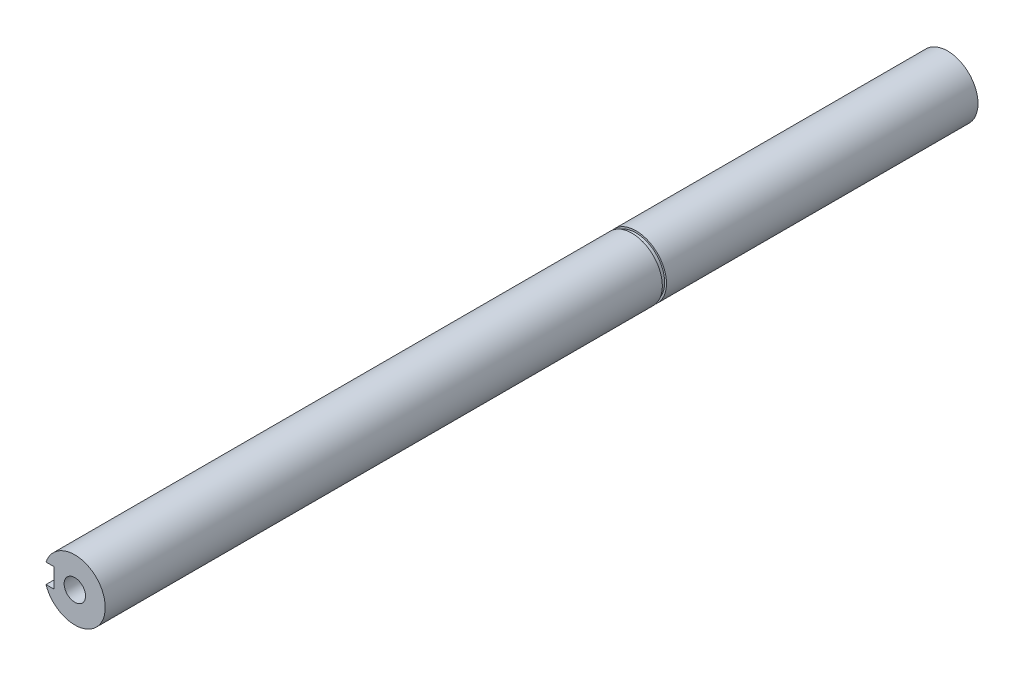
ISO-10303-21;
HEADER;
FILE_DESCRIPTION(('STEP AP214'),'2;1');
FILE_NAME('part.step','',(''),(''),'','','');
FILE_SCHEMA(('AUTOMOTIVE_DESIGN { 1 0 10303 214 1 1 1 1 }'));
ENDSEC;
DATA;
#1=APPLICATION_CONTEXT('core data for automotive mechanical design processes');
#2=APPLICATION_PROTOCOL_DEFINITION('international standard','automotive_design',2000,#1);
#3=PRODUCT_CONTEXT('',#1,'mechanical');
#4=PRODUCT('Part','Part','',(#3));
#5=PRODUCT_RELATED_PRODUCT_CATEGORY('part','',(#4));
#6=PRODUCT_DEFINITION_FORMATION('','',#4);
#7=PRODUCT_DEFINITION_CONTEXT('part definition',#1,'design');
#8=PRODUCT_DEFINITION('design','',#6,#7);
#9=PRODUCT_DEFINITION_SHAPE('','',#8);
#10=(LENGTH_UNIT() NAMED_UNIT(*) SI_UNIT(.MILLI.,.METRE.));
#11=(NAMED_UNIT(*) PLANE_ANGLE_UNIT() SI_UNIT($,.RADIAN.));
#12=(NAMED_UNIT(*) SI_UNIT($,.STERADIAN.) SOLID_ANGLE_UNIT());
#13=UNCERTAINTY_MEASURE_WITH_UNIT(LENGTH_MEASURE(1.E-05),#10,'distance_accuracy_value','');
#14=(GEOMETRIC_REPRESENTATION_CONTEXT(3) GLOBAL_UNCERTAINTY_ASSIGNED_CONTEXT((#13)) GLOBAL_UNIT_ASSIGNED_CONTEXT((#10,
#11,#12)) REPRESENTATION_CONTEXT('',''));
#15=CARTESIAN_POINT('',(0.,0.,0.));
#16=DIRECTION('',(0.,0.,1.));
#17=DIRECTION('',(1.,0.,0.));
#18=AXIS2_PLACEMENT_3D('',#15,#16,#17);
#19=CARTESIAN_POINT('',(1.72084568816899E-12,-291.807573628489,-395.955339059327));
#20=DIRECTION('',(0.,0.,1.));
#21=DIRECTION('',(1.,0.,0.));
#22=AXIS2_PLACEMENT_3D('',#19,#20,#21);
#23=CYLINDRICAL_SURFACE('',#22,12.5);
#24=DIRECTION('',(0.,0.,1.));
#25=VECTOR('',#24,1.);
#26=CARTESIAN_POINT('',(-11.8427192823253,-287.807573628489,-395.955339059327));
#27=LINE('',#26,#25);
#28=CARTESIAN_POINT('',(-11.8427192823253,-287.807573628489,0.));
#29=VERTEX_POINT('',#28);
#30=CARTESIAN_POINT('',(-11.8427192823253,-287.807573628489,-30.));
#31=VERTEX_POINT('',#30);
#32=EDGE_CURVE('E202',#29,#31,#27,.F.);
#33=ORIENTED_EDGE('',*,*,#32,.F.);
#34=CARTESIAN_POINT('',(1.72084568816899E-12,-291.807573628489,0.));
#35=DIRECTION('',(0.,0.,1.));
#36=DIRECTION('',(1.,0.,0.));
#37=AXIS2_PLACEMENT_3D('',#34,#35,#36);
#38=CIRCLE('',#37,12.5);
#39=CARTESIAN_POINT('',(-11.8427192823253,-295.807573628489,0.));
#40=VERTEX_POINT('',#39);
#41=EDGE_CURVE('E192',#40,#29,#38,.T.);
#42=ORIENTED_EDGE('',*,*,#41,.F.);
#43=DIRECTION('',(0.,0.,1.));
#44=VECTOR('',#43,1.);
#45=CARTESIAN_POINT('',(-11.8427192823253,-295.807573628489,-395.955339059327));
#46=LINE('',#45,#44);
#47=CARTESIAN_POINT('',(-11.8427192823253,-295.807573628489,-30.));
#48=VERTEX_POINT('',#47);
#49=EDGE_CURVE('E198',#48,#40,#46,.T.);
#50=ORIENTED_EDGE('',*,*,#49,.F.);
#51=CARTESIAN_POINT('',(1.72084568816899E-12,-291.807573628489,-30.));
#52=DIRECTION('',(0.,0.,-1.));
#53=DIRECTION('',(-1.,0.,0.));
#54=AXIS2_PLACEMENT_3D('',#51,#52,#53);
#55=CIRCLE('',#54,12.5);
#56=EDGE_CURVE('E200',#31,#48,#55,.F.);
#57=ORIENTED_EDGE('',*,*,#56,.F.);
#58=EDGE_LOOP('',(#33,#42,#50,#57));
#59=FACE_BOUND('',#58,.T.);
#60=CARTESIAN_POINT('',(1.72084568816899E-12,-291.807573628489,-228.9));
#61=DIRECTION('',(0.,0.,-1.));
#62=DIRECTION('',(0.,1.,0.));
#63=AXIS2_PLACEMENT_3D('',#60,#61,#62);
#64=CIRCLE('',#63,12.5);
#65=CARTESIAN_POINT('',(1.72084568816899E-12,-279.307573628489,-228.9));
#66=VERTEX_POINT('',#65);
#67=EDGE_CURVE('E180',#66,#66,#64,.F.);
#68=ORIENTED_EDGE('',*,*,#67,.T.);
#69=EDGE_LOOP('',(#68));
#70=FACE_BOUND('',#69,.T.);
#71=ADVANCED_FACE('F48',(#59,#70),#23,.T.);
#72=CARTESIAN_POINT('',(1.72084568816899E-12,-291.807573628489,0.));
#73=DIRECTION('',(0.,0.,1.));
#74=DIRECTION('',(1.,0.,0.));
#75=AXIS2_PLACEMENT_3D('',#72,#73,#74);
#76=PLANE('',#75);
#77=CARTESIAN_POINT('',(1.72084568816899E-12,-291.807573628489,0.));
#78=DIRECTION('',(0.,0.,1.));
#79=DIRECTION('',(1.,0.,0.));
#80=AXIS2_PLACEMENT_3D('',#77,#78,#79);
#81=CIRCLE('',#80,4.4);
#82=CARTESIAN_POINT('',(4.40000000000172,-291.807573628489,0.));
#83=VERTEX_POINT('',#82);
#84=EDGE_CURVE('E133',#83,#83,#81,.T.);
#85=ORIENTED_EDGE('',*,*,#84,.F.);
#86=EDGE_LOOP('',(#85));
#87=FACE_BOUND('',#86,.T.);
#88=DIRECTION('',(-1.,0.,0.));
#89=VECTOR('',#88,1.);
#90=CARTESIAN_POINT('',(-16.4999999999983,-287.807573628489,0.));
#91=LINE('',#90,#89);
#92=CARTESIAN_POINT('',(-8.49999999999829,-287.807573628489,0.));
#93=VERTEX_POINT('',#92);
#94=EDGE_CURVE('E175',#93,#29,#91,.T.);
#95=ORIENTED_EDGE('',*,*,#94,.F.);
#96=DIRECTION('',(0.,1.,0.));
#97=VECTOR('',#96,1.);
#98=CARTESIAN_POINT('',(-8.49999999999829,-287.807573628489,0.));
#99=LINE('',#98,#97);
#100=CARTESIAN_POINT('',(-8.49999999999829,-295.807573628489,0.));
#101=VERTEX_POINT('',#100);
#102=EDGE_CURVE('E177',#101,#93,#99,.T.);
#103=ORIENTED_EDGE('',*,*,#102,.F.);
#104=DIRECTION('',(1.,0.,0.));
#105=VECTOR('',#104,1.);
#106=CARTESIAN_POINT('',(-16.4999999999983,-295.807573628489,0.));
#107=LINE('',#106,#105);
#108=EDGE_CURVE('E172',#40,#101,#107,.T.);
#109=ORIENTED_EDGE('',*,*,#108,.F.);
#110=ORIENTED_EDGE('',*,*,#41,.T.);
#111=EDGE_LOOP('',(#95,#103,#109,#110));
#112=FACE_BOUND('',#111,.T.);
#113=ADVANCED_FACE('F245',(#87,#112),#76,.T.);
#114=CARTESIAN_POINT('',(0.,0.,-30.));
#115=DIRECTION('',(0.,0.,-1.));
#116=DIRECTION('',(-1.,0.,0.));
#117=AXIS2_PLACEMENT_3D('',#114,#115,#116);
#118=PLANE('',#117);
#119=ORIENTED_EDGE('',*,*,#56,.T.);
#120=DIRECTION('',(1.,0.,0.));
#121=VECTOR('',#120,1.);
#122=CARTESIAN_POINT('',(-16.4999999999983,-295.807573628489,-30.));
#123=LINE('',#122,#121);
#124=CARTESIAN_POINT('',(-8.49999999999829,-295.807573628489,-30.));
#125=VERTEX_POINT('',#124);
#126=EDGE_CURVE('E71',#48,#125,#123,.T.);
#127=ORIENTED_EDGE('',*,*,#126,.T.);
#128=DIRECTION('',(0.,1.,0.));
#129=VECTOR('',#128,1.);
#130=CARTESIAN_POINT('',(-8.49999999999829,-287.807573628489,-30.));
#131=LINE('',#130,#129);
#132=CARTESIAN_POINT('',(-8.49999999999829,-287.807573628489,-30.));
#133=VERTEX_POINT('',#132);
#134=EDGE_CURVE('E183',#125,#133,#131,.T.);
#135=ORIENTED_EDGE('',*,*,#134,.T.);
#136=DIRECTION('',(-1.,0.,0.));
#137=VECTOR('',#136,1.);
#138=CARTESIAN_POINT('',(-16.4999999999983,-287.807573628489,-30.));
#139=LINE('',#138,#137);
#140=EDGE_CURVE('E174',#133,#31,#139,.T.);
#141=ORIENTED_EDGE('',*,*,#140,.T.);
#142=EDGE_LOOP('',(#119,#127,#135,#141));
#143=FACE_BOUND('',#142,.T.);
#144=ADVANCED_FACE('F250',(#143),#118,.F.);
#145=CARTESIAN_POINT('',(-16.4999999999983,-287.807573628489,-41.3137084989848));
#146=DIRECTION('',(0.,1.,0.));
#147=DIRECTION('',(0.,0.,1.));
#148=AXIS2_PLACEMENT_3D('',#145,#146,#147);
#149=PLANE('',#148);
#150=ORIENTED_EDGE('',*,*,#32,.T.);
#151=ORIENTED_EDGE('',*,*,#140,.F.);
#152=DIRECTION('',(0.,0.,1.));
#153=VECTOR('',#152,1.);
#154=CARTESIAN_POINT('',(-8.49999999999829,-287.807573628489,-41.3137084989848));
#155=LINE('',#154,#153);
#156=EDGE_CURVE('E186',#133,#93,#155,.T.);
#157=ORIENTED_EDGE('',*,*,#156,.T.);
#158=ORIENTED_EDGE('',*,*,#94,.T.);
#159=EDGE_LOOP('',(#150,#151,#157,#158));
#160=FACE_BOUND('',#159,.T.);
#161=ADVANCED_FACE('F287',(#160),#149,.F.);
#162=CARTESIAN_POINT('',(-16.4999999999983,-295.807573628489,-41.3137084989848));
#163=DIRECTION('',(0.,-1.,0.));
#164=DIRECTION('',(0.,0.,-1.));
#165=AXIS2_PLACEMENT_3D('',#162,#163,#164);
#166=PLANE('',#165);
#167=ORIENTED_EDGE('',*,*,#49,.T.);
#168=ORIENTED_EDGE('',*,*,#108,.T.);
#169=DIRECTION('',(0.,0.,1.));
#170=VECTOR('',#169,1.);
#171=CARTESIAN_POINT('',(-8.49999999999829,-295.807573628489,-41.3137084989848));
#172=LINE('',#171,#170);
#173=EDGE_CURVE('E187',#125,#101,#172,.T.);
#174=ORIENTED_EDGE('',*,*,#173,.F.);
#175=ORIENTED_EDGE('',*,*,#126,.F.);
#176=EDGE_LOOP('',(#167,#168,#174,#175));
#177=FACE_BOUND('',#176,.T.);
#178=ADVANCED_FACE('F295',(#177),#166,.F.);
#179=CARTESIAN_POINT('',(-8.49999999999829,-287.807573628489,-41.3137084989848));
#180=DIRECTION('',(1.,0.,0.));
#181=DIRECTION('',(0.,0.,-1.));
#182=AXIS2_PLACEMENT_3D('',#179,#180,#181);
#183=PLANE('',#182);
#184=ORIENTED_EDGE('',*,*,#173,.T.);
#185=ORIENTED_EDGE('',*,*,#102,.T.);
#186=ORIENTED_EDGE('',*,*,#156,.F.);
#187=ORIENTED_EDGE('',*,*,#134,.F.);
#188=EDGE_LOOP('',(#184,#185,#186,#187));
#189=FACE_BOUND('',#188,.T.);
#190=ADVANCED_FACE('F294',(#189),#183,.F.);
#191=CARTESIAN_POINT('',(0.,-291.807573628489,-228.9));
#192=DIRECTION('',(0.,0.,-1.));
#193=DIRECTION('',(0.,1.,0.));
#194=AXIS2_PLACEMENT_3D('',#191,#192,#193);
#195=PLANE('',#194);
#196=ORIENTED_EDGE('',*,*,#67,.F.);
#197=EDGE_LOOP('',(#196));
#198=FACE_BOUND('',#197,.T.);
#199=CARTESIAN_POINT('',(0.,-291.807573628489,-228.9));
#200=DIRECTION('',(0.,0.,-1.));
#201=DIRECTION('',(0.,1.,0.));
#202=AXIS2_PLACEMENT_3D('',#199,#200,#201);
#203=CIRCLE('',#202,11.75);
#204=CARTESIAN_POINT('',(0.,-280.057573628489,-228.9));
#205=VERTEX_POINT('',#204);
#206=EDGE_CURVE('E166',#205,#205,#203,.T.);
#207=ORIENTED_EDGE('',*,*,#206,.F.);
#208=EDGE_LOOP('',(#207));
#209=FACE_BOUND('',#208,.T.);
#210=ADVANCED_FACE('F302',(#198,#209),#195,.T.);
#211=CARTESIAN_POINT('',(0.,-291.807573628489,-230.6));
#212=DIRECTION('',(0.,0.,-1.));
#213=DIRECTION('',(0.,1.,0.));
#214=AXIS2_PLACEMENT_3D('',#211,#212,#213);
#215=PLANE('',#214);
#216=CARTESIAN_POINT('',(0.,-291.807573628489,-230.6));
#217=DIRECTION('',(0.,0.,-1.));
#218=DIRECTION('',(0.,1.,0.));
#219=AXIS2_PLACEMENT_3D('',#216,#217,#218);
#220=CIRCLE('',#219,11.75);
#221=CARTESIAN_POINT('',(-11.0481898969923,-287.807573628489,-230.6));
#222=VERTEX_POINT('',#221);
#223=CARTESIAN_POINT('',(-11.048189896992,-295.807573628489,-230.6));
#224=VERTEX_POINT('',#223);
#225=EDGE_CURVE('E165',#222,#224,#220,.T.);
#226=ORIENTED_EDGE('',*,*,#225,.T.);
#227=DIRECTION('',(-1.,0.,0.));
#228=VECTOR('',#227,1.);
#229=CARTESIAN_POINT('',(-16.4999999999983,-295.807573628489,-230.6));
#230=LINE('',#229,#228);
#231=CARTESIAN_POINT('',(-11.8427192823253,-295.807573628489,-230.6));
#232=VERTEX_POINT('',#231);
#233=EDGE_CURVE('E147',#224,#232,#230,.T.);
#234=ORIENTED_EDGE('',*,*,#233,.T.);
#235=CARTESIAN_POINT('',(1.72084568816899E-12,-291.807573628489,-230.6));
#236=DIRECTION('',(0.,0.,-1.));
#237=DIRECTION('',(0.,1.,0.));
#238=AXIS2_PLACEMENT_3D('',#235,#236,#237);
#239=CIRCLE('',#238,12.5);
#240=CARTESIAN_POINT('',(-11.8427192823253,-287.807573628489,-230.6));
#241=VERTEX_POINT('',#240);
#242=EDGE_CURVE('E169',#232,#241,#239,.F.);
#243=ORIENTED_EDGE('',*,*,#242,.T.);
#244=DIRECTION('',(1.,0.,0.));
#245=VECTOR('',#244,1.);
#246=CARTESIAN_POINT('',(-16.4999999999983,-287.807573628489,-230.6));
#247=LINE('',#246,#245);
#248=EDGE_CURVE('E63',#241,#222,#247,.T.);
#249=ORIENTED_EDGE('',*,*,#248,.T.);
#250=EDGE_LOOP('',(#226,#234,#243,#249));
#251=FACE_BOUND('',#250,.T.);
#252=ADVANCED_FACE('F223',(#251),#215,.F.);
#253=CARTESIAN_POINT('',(0.,-291.807573628489,-228.9));
#254=DIRECTION('',(0.,0.,-1.));
#255=DIRECTION('',(0.,1.,0.));
#256=AXIS2_PLACEMENT_3D('',#253,#254,#255);
#257=CYLINDRICAL_SURFACE('',#256,11.75);
#258=ORIENTED_EDGE('',*,*,#206,.T.);
#259=EDGE_LOOP('',(#258));
#260=FACE_BOUND('',#259,.T.);
#261=EDGE_CURVE('E170',#224,#222,#220,.T.);
#262=ORIENTED_EDGE('',*,*,#261,.F.);
#263=ORIENTED_EDGE('',*,*,#225,.F.);
#264=EDGE_LOOP('',(#262,#263));
#265=FACE_BOUND('',#264,.T.);
#266=ADVANCED_FACE('F227',(#260,#265),#257,.T.);
#267=CARTESIAN_POINT('',(0.,-291.807573628489,-358.6));
#268=DIRECTION('',(0.,0.,-1.));
#269=DIRECTION('',(-0.000997046454992136,-0.99999950294906,0.));
#270=AXIS2_PLACEMENT_3D('',#267,#268,#269);
#271=PLANE('',#270);
#272=CARTESIAN_POINT('',(1.72084568816899E-12,-291.807573628489,-358.6));
#273=DIRECTION('',(0.,0.,-1.));
#274=DIRECTION('',(0.,1.,0.));
#275=AXIS2_PLACEMENT_3D('',#272,#273,#274);
#276=CIRCLE('',#275,4.39999999999999);
#277=CARTESIAN_POINT('',(1.72084568816899E-12,-287.407573628489,-358.6));
#278=VERTEX_POINT('',#277);
#279=EDGE_CURVE('E134',#278,#278,#276,.T.);
#280=ORIENTED_EDGE('',*,*,#279,.F.);
#281=EDGE_LOOP('',(#280));
#282=FACE_BOUND('',#281,.T.);
#283=DIRECTION('',(-1.,0.,0.));
#284=VECTOR('',#283,1.);
#285=CARTESIAN_POINT('',(-16.4999999999983,-295.807573628489,-358.6));
#286=LINE('',#285,#284);
#287=CARTESIAN_POINT('',(-8.49999999999829,-295.807573628489,-358.6));
#288=VERTEX_POINT('',#287);
#289=CARTESIAN_POINT('',(-11.8427192823253,-295.807573628489,-358.6));
#290=VERTEX_POINT('',#289);
#291=EDGE_CURVE('E148',#288,#290,#286,.T.);
#292=ORIENTED_EDGE('',*,*,#291,.F.);
#293=DIRECTION('',(0.,-1.,0.));
#294=VECTOR('',#293,1.);
#295=CARTESIAN_POINT('',(-8.49999999999829,-295.807573628489,-358.6));
#296=LINE('',#295,#294);
#297=CARTESIAN_POINT('',(-8.49999999999829,-287.807573628489,-358.6));
#298=VERTEX_POINT('',#297);
#299=EDGE_CURVE('E144',#298,#288,#296,.T.);
#300=ORIENTED_EDGE('',*,*,#299,.F.);
#301=DIRECTION('',(1.,0.,0.));
#302=VECTOR('',#301,1.);
#303=CARTESIAN_POINT('',(-16.4999999999983,-287.807573628489,-358.6));
#304=LINE('',#303,#302);
#305=CARTESIAN_POINT('',(-11.8427192823253,-287.807573628489,-358.6));
#306=VERTEX_POINT('',#305);
#307=EDGE_CURVE('E145',#306,#298,#304,.T.);
#308=ORIENTED_EDGE('',*,*,#307,.F.);
#309=CARTESIAN_POINT('',(1.72084568816899E-12,-291.807573628489,-358.6));
#310=DIRECTION('',(0.,0.,-1.));
#311=DIRECTION('',(0.,1.,0.));
#312=AXIS2_PLACEMENT_3D('',#309,#310,#311);
#313=CIRCLE('',#312,12.5);
#314=EDGE_CURVE('E195',#290,#306,#313,.F.);
#315=ORIENTED_EDGE('',*,*,#314,.F.);
#316=EDGE_LOOP('',(#292,#300,#308,#315));
#317=FACE_BOUND('',#316,.T.);
#318=ADVANCED_FACE('F50',(#282,#317),#271,.T.);
#319=DIRECTION('',(0.,0.,1.));
#320=VECTOR('',#319,1.);
#321=CARTESIAN_POINT('',(-11.8427192823253,-295.807573628489,-395.955339059327));
#322=LINE('',#321,#320);
#323=EDGE_CURVE('E13',#290,#232,#322,.T.);
#324=ORIENTED_EDGE('',*,*,#323,.F.);
#325=ORIENTED_EDGE('',*,*,#314,.T.);
#326=DIRECTION('',(0.,0.,1.));
#327=VECTOR('',#326,1.);
#328=CARTESIAN_POINT('',(-11.8427192823253,-287.807573628489,-395.955339059327));
#329=LINE('',#328,#327);
#330=EDGE_CURVE('E56',#241,#306,#329,.F.);
#331=ORIENTED_EDGE('',*,*,#330,.F.);
#332=ORIENTED_EDGE('',*,*,#242,.F.);
#333=EDGE_LOOP('',(#324,#325,#331,#332));
#334=FACE_BOUND('',#333,.T.);
#335=ADVANCED_FACE('F217',(#334),#23,.T.);
#336=CARTESIAN_POINT('',(12.50249975005,-289.307573628489,-230.6));
#337=DIRECTION('',(0.,0.,1.));
#338=DIRECTION('',(0.,1.,0.));
#339=AXIS2_PLACEMENT_3D('',#336,#337,#338);
#340=PLANE('',#339);
#341=ORIENTED_EDGE('',*,*,#261,.T.);
#342=CARTESIAN_POINT('',(-8.49999999999829,-287.807573628489,-230.6));
#343=VERTEX_POINT('',#342);
#344=EDGE_CURVE('E155',#222,#343,#247,.T.);
#345=ORIENTED_EDGE('',*,*,#344,.T.);
#346=DIRECTION('',(0.,-1.,0.));
#347=VECTOR('',#346,1.);
#348=CARTESIAN_POINT('',(-8.49999999999829,-295.807573628489,-230.6));
#349=LINE('',#348,#347);
#350=CARTESIAN_POINT('',(-8.49999999999829,-295.807573628489,-230.6));
#351=VERTEX_POINT('',#350);
#352=EDGE_CURVE('E156',#343,#351,#349,.T.);
#353=ORIENTED_EDGE('',*,*,#352,.T.);
#354=EDGE_CURVE('E152',#351,#224,#230,.T.);
#355=ORIENTED_EDGE('',*,*,#354,.T.);
#356=EDGE_LOOP('',(#341,#345,#353,#355));
#357=FACE_BOUND('',#356,.T.);
#358=ADVANCED_FACE('F229',(#357),#340,.F.);
#359=CARTESIAN_POINT('',(-16.4999999999983,-295.807573628489,-219.286291501015));
#360=DIRECTION('',(0.,-1.,0.));
#361=DIRECTION('',(0.,0.,-1.));
#362=AXIS2_PLACEMENT_3D('',#359,#360,#361);
#363=PLANE('',#362);
#364=ORIENTED_EDGE('',*,*,#323,.T.);
#365=ORIENTED_EDGE('',*,*,#233,.F.);
#366=ORIENTED_EDGE('',*,*,#354,.F.);
#367=DIRECTION('',(0.,0.,-1.));
#368=VECTOR('',#367,1.);
#369=CARTESIAN_POINT('',(-8.49999999999829,-295.807573628489,-219.286291501015));
#370=LINE('',#369,#368);
#371=EDGE_CURVE('E159',#351,#288,#370,.T.);
#372=ORIENTED_EDGE('',*,*,#371,.T.);
#373=ORIENTED_EDGE('',*,*,#291,.T.);
#374=EDGE_LOOP('',(#364,#365,#366,#372,#373));
#375=FACE_BOUND('',#374,.T.);
#376=ADVANCED_FACE('F220',(#375),#363,.F.);
#377=CARTESIAN_POINT('',(-16.4999999999983,-287.807573628489,-219.286291501015));
#378=DIRECTION('',(0.,1.,0.));
#379=DIRECTION('',(0.,0.,1.));
#380=AXIS2_PLACEMENT_3D('',#377,#378,#379);
#381=PLANE('',#380);
#382=ORIENTED_EDGE('',*,*,#330,.T.);
#383=ORIENTED_EDGE('',*,*,#307,.T.);
#384=DIRECTION('',(0.,0.,-1.));
#385=VECTOR('',#384,1.);
#386=CARTESIAN_POINT('',(-8.49999999999829,-287.807573628489,-219.286291501015));
#387=LINE('',#386,#385);
#388=EDGE_CURVE('E160',#343,#298,#387,.T.);
#389=ORIENTED_EDGE('',*,*,#388,.F.);
#390=ORIENTED_EDGE('',*,*,#344,.F.);
#391=ORIENTED_EDGE('',*,*,#248,.F.);
#392=EDGE_LOOP('',(#382,#383,#389,#390,#391));
#393=FACE_BOUND('',#392,.T.);
#394=ADVANCED_FACE('F208',(#393),#381,.F.);
#395=CARTESIAN_POINT('',(-8.49999999999829,-295.807573628489,-219.286291501015));
#396=DIRECTION('',(1.,0.,0.));
#397=DIRECTION('',(0.,0.,-1.));
#398=AXIS2_PLACEMENT_3D('',#395,#396,#397);
#399=PLANE('',#398);
#400=ORIENTED_EDGE('',*,*,#388,.T.);
#401=ORIENTED_EDGE('',*,*,#299,.T.);
#402=ORIENTED_EDGE('',*,*,#371,.F.);
#403=ORIENTED_EDGE('',*,*,#352,.F.);
#404=EDGE_LOOP('',(#400,#401,#402,#403));
#405=FACE_BOUND('',#404,.T.);
#406=ADVANCED_FACE('F232',(#405),#399,.F.);
#407=CARTESIAN_POINT('',(1.72084568816899E-12,-291.807573628489,-32.5));
#408=DIRECTION('',(0.,0.,1.));
#409=DIRECTION('',(1.,0.,0.));
#410=AXIS2_PLACEMENT_3D('',#407,#408,#409);
#411=CONICAL_SURFACE('',#410,4.39999999999999,1.02974425867665);
#412=CARTESIAN_POINT('',(1.69309011255336E-12,-291.807573628489,-35.1437867237213));
#413=VERTEX_POINT('',#412);
#414=VERTEX_LOOP('',#413);
#415=FACE_BOUND('',#414,.T.);
#416=CARTESIAN_POINT('',(1.72084568816899E-12,-291.807573628489,-32.5));
#417=DIRECTION('',(0.,0.,1.));
#418=DIRECTION('',(1.,0.,0.));
#419=AXIS2_PLACEMENT_3D('',#416,#417,#418);
#420=CIRCLE('',#419,4.39999999999999);
#421=CARTESIAN_POINT('',(4.40000000000171,-291.807573628489,-32.5));
#422=VERTEX_POINT('',#421);
#423=EDGE_CURVE('E137',#422,#422,#420,.T.);
#424=ORIENTED_EDGE('',*,*,#423,.T.);
#425=EDGE_LOOP('',(#424));
#426=FACE_BOUND('',#425,.T.);
#427=ADVANCED_FACE('F235',(#415,#426),#411,.F.);
#428=CARTESIAN_POINT('',(1.72084568816899E-12,-291.807573628489,0.));
#429=DIRECTION('',(0.,0.,1.));
#430=DIRECTION('',(1.,0.,0.));
#431=AXIS2_PLACEMENT_3D('',#428,#429,#430);
#432=CYLINDRICAL_SURFACE('',#431,4.39999999999999);
#433=ORIENTED_EDGE('',*,*,#423,.F.);
#434=EDGE_LOOP('',(#433));
#435=FACE_BOUND('',#434,.T.);
#436=ORIENTED_EDGE('',*,*,#84,.T.);
#437=EDGE_LOOP('',(#436));
#438=FACE_BOUND('',#437,.T.);
#439=ADVANCED_FACE('F127',(#435,#438),#432,.F.);
#440=CARTESIAN_POINT('',(1.72084568816899E-12,-291.807573628489,-326.1));
#441=DIRECTION('',(0.,0.,-1.));
#442=DIRECTION('',(0.,1.,0.));
#443=AXIS2_PLACEMENT_3D('',#440,#441,#442);
#444=CONICAL_SURFACE('',#443,4.39999999999998,1.02974425867665);
#445=CARTESIAN_POINT('',(1.69309011255336E-12,-291.807573628489,-323.456213276279));
#446=VERTEX_POINT('',#445);
#447=VERTEX_LOOP('',#446);
#448=FACE_BOUND('',#447,.T.);
#449=CARTESIAN_POINT('',(1.72084568816899E-12,-291.807573628489,-326.1));
#450=DIRECTION('',(0.,0.,-1.));
#451=DIRECTION('',(0.,1.,0.));
#452=AXIS2_PLACEMENT_3D('',#449,#450,#451);
#453=CIRCLE('',#452,4.39999999999998);
#454=CARTESIAN_POINT('',(1.72084568816899E-12,-287.407573628489,-326.1));
#455=VERTEX_POINT('',#454);
#456=EDGE_CURVE('E131',#455,#455,#453,.T.);
#457=ORIENTED_EDGE('',*,*,#456,.T.);
#458=EDGE_LOOP('',(#457));
#459=FACE_BOUND('',#458,.T.);
#460=ADVANCED_FACE('F123',(#448,#459),#444,.F.);
#461=CARTESIAN_POINT('',(1.72084568816899E-12,-291.807573628489,-358.6));
#462=DIRECTION('',(0.,0.,-1.));
#463=DIRECTION('',(0.,1.,0.));
#464=AXIS2_PLACEMENT_3D('',#461,#462,#463);
#465=CYLINDRICAL_SURFACE('',#464,4.39999999999999);
#466=ORIENTED_EDGE('',*,*,#456,.F.);
#467=EDGE_LOOP('',(#466));
#468=FACE_BOUND('',#467,.T.);
#469=ORIENTED_EDGE('',*,*,#279,.T.);
#470=EDGE_LOOP('',(#469));
#471=FACE_BOUND('',#470,.T.);
#472=ADVANCED_FACE('F126',(#468,#471),#465,.F.);
#473=CLOSED_SHELL('',(#71,#113,#144,#161,#178,#190,#210,#252,#266,#318,#335,#358,#376,#394,#406,
#427,#439,#460,#472));
#474=MANIFOLD_SOLID_BREP('B2',#473);
#475=ADVANCED_BREP_SHAPE_REPRESENTATION('',(#18,#474),#14);
#476=SHAPE_DEFINITION_REPRESENTATION(#9,#475);
ENDSEC;
END-ISO-10303-21;
